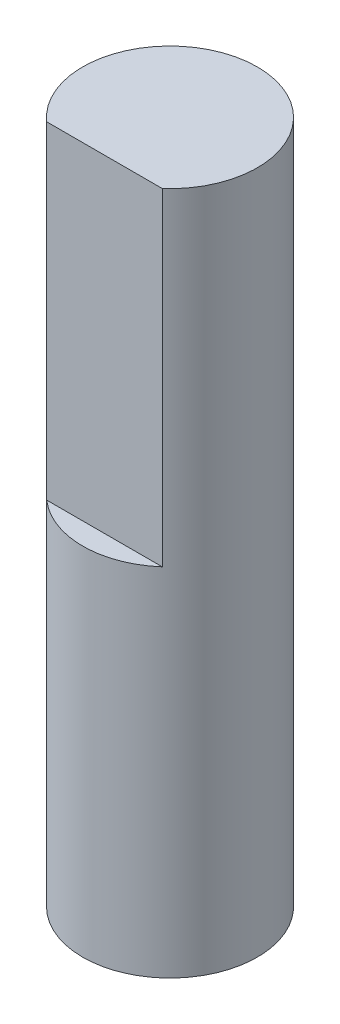
ISO-10303-21;
HEADER;
FILE_DESCRIPTION(('STEP AP214'),'2;1');
FILE_NAME('part.step','',(''),(''),'','','');
FILE_SCHEMA(('AUTOMOTIVE_DESIGN { 1 0 10303 214 1 1 1 1 }'));
ENDSEC;
DATA;
#1=APPLICATION_CONTEXT('core data for automotive mechanical design processes');
#2=APPLICATION_PROTOCOL_DEFINITION('international standard','automotive_design',2000,#1);
#3=PRODUCT_CONTEXT('',#1,'mechanical');
#4=PRODUCT('Part','Part','',(#3));
#5=PRODUCT_RELATED_PRODUCT_CATEGORY('part','',(#4));
#6=PRODUCT_DEFINITION_FORMATION('','',#4);
#7=PRODUCT_DEFINITION_CONTEXT('part definition',#1,'design');
#8=PRODUCT_DEFINITION('design','',#6,#7);
#9=PRODUCT_DEFINITION_SHAPE('','',#8);
#10=(LENGTH_UNIT() NAMED_UNIT(*) SI_UNIT(.MILLI.,.METRE.));
#11=(NAMED_UNIT(*) PLANE_ANGLE_UNIT() SI_UNIT($,.RADIAN.));
#12=(NAMED_UNIT(*) SI_UNIT($,.STERADIAN.) SOLID_ANGLE_UNIT());
#13=UNCERTAINTY_MEASURE_WITH_UNIT(LENGTH_MEASURE(1.E-05),#10,'distance_accuracy_value','');
#14=(GEOMETRIC_REPRESENTATION_CONTEXT(3) GLOBAL_UNCERTAINTY_ASSIGNED_CONTEXT((#13)) GLOBAL_UNIT_ASSIGNED_CONTEXT((#10,
#11,#12)) REPRESENTATION_CONTEXT('',''));
#15=CARTESIAN_POINT('',(0.,0.,0.));
#16=DIRECTION('',(0.,0.,1.));
#17=DIRECTION('',(1.,0.,0.));
#18=AXIS2_PLACEMENT_3D('',#15,#16,#17);
#19=CARTESIAN_POINT('',(0.,31.3,0.));
#20=DIRECTION('',(0.,-1.,0.));
#21=DIRECTION('',(0.,0.,-1.));
#22=AXIS2_PLACEMENT_3D('',#19,#20,#21);
#23=CYLINDRICAL_SURFACE('',#22,4.);
#24=CARTESIAN_POINT('',(0.,31.3,0.));
#25=DIRECTION('',(0.,1.,0.));
#26=DIRECTION('',(0.,0.,1.));
#27=AXIS2_PLACEMENT_3D('',#24,#25,#26);
#28=CIRCLE('',#27,4.);
#29=CARTESIAN_POINT('',(2.64575131106459,31.3,3.));
#30=VERTEX_POINT('',#29);
#31=CARTESIAN_POINT('',(-2.64575131106459,31.3,3.));
#32=VERTEX_POINT('',#31);
#33=EDGE_CURVE('E11',#30,#32,#28,.T.);
#34=ORIENTED_EDGE('',*,*,#33,.F.);
#35=DIRECTION('',(0.,1.,0.));
#36=VECTOR('',#35,1.);
#37=CARTESIAN_POINT('',(2.64575131106459,16.3,3.));
#38=LINE('',#37,#36);
#39=CARTESIAN_POINT('',(2.64575131106459,16.3,3.));
#40=VERTEX_POINT('',#39);
#41=EDGE_CURVE('E50',#40,#30,#38,.T.);
#42=ORIENTED_EDGE('',*,*,#41,.F.);
#43=CARTESIAN_POINT('',(0.,16.3,0.));
#44=DIRECTION('',(0.,1.,0.));
#45=DIRECTION('',(0.,0.,1.));
#46=AXIS2_PLACEMENT_3D('',#43,#44,#45);
#47=CIRCLE('',#46,4.);
#48=CARTESIAN_POINT('',(-2.64575131106459,16.3,3.));
#49=VERTEX_POINT('',#48);
#50=EDGE_CURVE('E65',#49,#40,#47,.T.);
#51=ORIENTED_EDGE('',*,*,#50,.F.);
#52=DIRECTION('',(0.,1.,0.));
#53=VECTOR('',#52,1.);
#54=CARTESIAN_POINT('',(-2.64575131106459,16.3,3.));
#55=LINE('',#54,#53);
#56=EDGE_CURVE('E56',#49,#32,#55,.T.);
#57=ORIENTED_EDGE('',*,*,#56,.T.);
#58=EDGE_LOOP('',(#34,#42,#51,#57));
#59=FACE_BOUND('',#58,.T.);
#60=CARTESIAN_POINT('',(0.,0.,0.));
#61=DIRECTION('',(0.,1.,0.));
#62=DIRECTION('',(0.,0.,1.));
#63=AXIS2_PLACEMENT_3D('',#60,#61,#62);
#64=CIRCLE('',#63,4.);
#65=CARTESIAN_POINT('',(0.,0.,4.));
#66=VERTEX_POINT('',#65);
#67=EDGE_CURVE('E39',#66,#66,#64,.T.);
#68=ORIENTED_EDGE('',*,*,#67,.T.);
#69=EDGE_LOOP('',(#68));
#70=FACE_BOUND('',#69,.T.);
#71=ADVANCED_FACE('F36',(#59,#70),#23,.T.);
#72=CARTESIAN_POINT('',(0.,31.3,0.));
#73=DIRECTION('',(0.,1.,0.));
#74=DIRECTION('',(0.,0.,1.));
#75=AXIS2_PLACEMENT_3D('',#72,#73,#74);
#76=PLANE('',#75);
#77=DIRECTION('',(-1.,0.,0.));
#78=VECTOR('',#77,1.);
#79=CARTESIAN_POINT('',(-2.64575131106459,31.3,3.));
#80=LINE('',#79,#78);
#81=EDGE_CURVE('E61',#30,#32,#80,.T.);
#82=ORIENTED_EDGE('',*,*,#81,.F.);
#83=ORIENTED_EDGE('',*,*,#33,.T.);
#84=EDGE_LOOP('',(#82,#83));
#85=FACE_BOUND('',#84,.T.);
#86=ADVANCED_FACE('F71',(#85),#76,.T.);
#87=CARTESIAN_POINT('',(0.,0.,0.));
#88=DIRECTION('',(0.,1.,0.));
#89=DIRECTION('',(0.,0.,1.));
#90=AXIS2_PLACEMENT_3D('',#87,#88,#89);
#91=PLANE('',#90);
#92=ORIENTED_EDGE('',*,*,#67,.F.);
#93=EDGE_LOOP('',(#92));
#94=FACE_BOUND('',#93,.T.);
#95=ADVANCED_FACE('F73',(#94),#91,.F.);
#96=CARTESIAN_POINT('',(-2.64575131106459,16.3,3.));
#97=DIRECTION('',(0.,0.,-1.));
#98=DIRECTION('',(-1.,0.,0.));
#99=AXIS2_PLACEMENT_3D('',#96,#97,#98);
#100=PLANE('',#99);
#101=ORIENTED_EDGE('',*,*,#81,.T.);
#102=ORIENTED_EDGE('',*,*,#56,.F.);
#103=DIRECTION('',(-1.,0.,0.));
#104=VECTOR('',#103,1.);
#105=CARTESIAN_POINT('',(-2.64575131106459,16.3,3.));
#106=LINE('',#105,#104);
#107=EDGE_CURVE('E88',#40,#49,#106,.T.);
#108=ORIENTED_EDGE('',*,*,#107,.F.);
#109=ORIENTED_EDGE('',*,*,#41,.T.);
#110=EDGE_LOOP('',(#101,#102,#108,#109));
#111=FACE_BOUND('',#110,.T.);
#112=ADVANCED_FACE('F62',(#111),#100,.F.);
#113=CARTESIAN_POINT('',(0.,16.3,0.));
#114=DIRECTION('',(0.,1.,0.));
#115=DIRECTION('',(0.,0.,1.));
#116=AXIS2_PLACEMENT_3D('',#113,#114,#115);
#117=PLANE('',#116);
#118=ORIENTED_EDGE('',*,*,#50,.T.);
#119=ORIENTED_EDGE('',*,*,#107,.T.);
#120=EDGE_LOOP('',(#118,#119));
#121=FACE_BOUND('',#120,.T.);
#122=ADVANCED_FACE('F83',(#121),#117,.T.);
#123=CLOSED_SHELL('',(#71,#86,#95,#112,#122));
#124=MANIFOLD_SOLID_BREP('B2',#123);
#125=ADVANCED_BREP_SHAPE_REPRESENTATION('',(#18,#124),#14);
#126=SHAPE_DEFINITION_REPRESENTATION(#9,#125);
ENDSEC;
END-ISO-10303-21;
